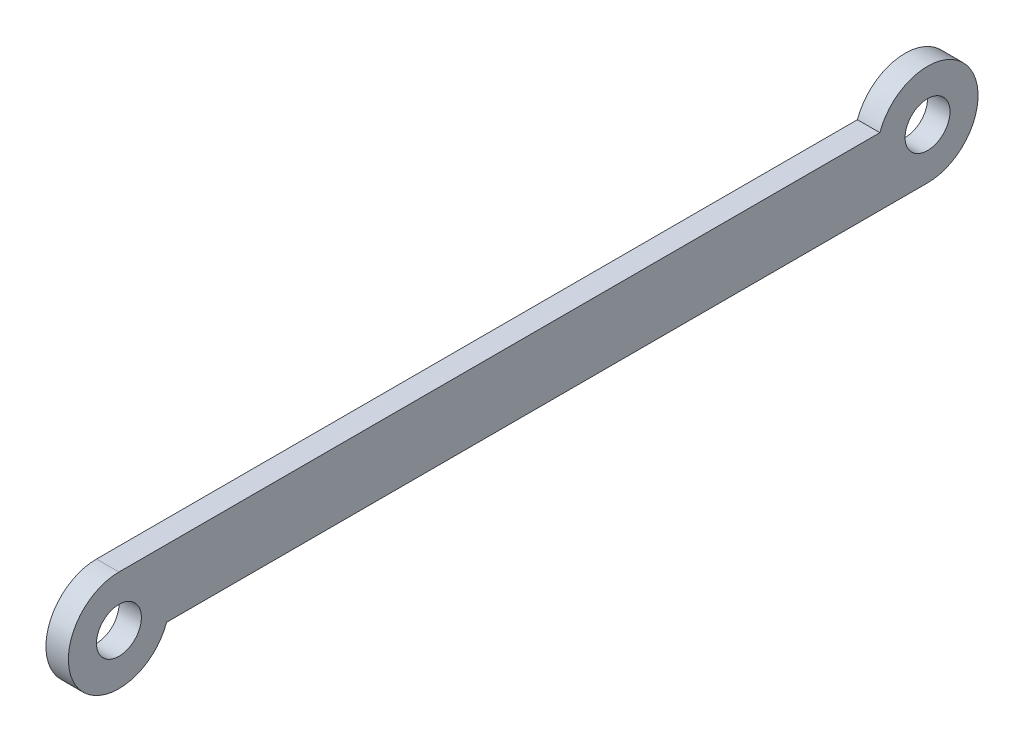
ISO-10303-21;
HEADER;
FILE_DESCRIPTION(('STEP AP214'),'2;1');
FILE_NAME('part.step','',(''),(''),'','','');
FILE_SCHEMA(('AUTOMOTIVE_DESIGN { 1 0 10303 214 1 1 1 1 }'));
ENDSEC;
DATA;
#1=APPLICATION_CONTEXT('core data for automotive mechanical design processes');
#2=APPLICATION_PROTOCOL_DEFINITION('international standard','automotive_design',2000,#1);
#3=PRODUCT_CONTEXT('',#1,'mechanical');
#4=PRODUCT('Part','Part','',(#3));
#5=PRODUCT_RELATED_PRODUCT_CATEGORY('part','',(#4));
#6=PRODUCT_DEFINITION_FORMATION('','',#4);
#7=PRODUCT_DEFINITION_CONTEXT('part definition',#1,'design');
#8=PRODUCT_DEFINITION('design','',#6,#7);
#9=PRODUCT_DEFINITION_SHAPE('','',#8);
#10=(LENGTH_UNIT() NAMED_UNIT(*) SI_UNIT(.MILLI.,.METRE.));
#11=(NAMED_UNIT(*) PLANE_ANGLE_UNIT() SI_UNIT($,.RADIAN.));
#12=(NAMED_UNIT(*) SI_UNIT($,.STERADIAN.) SOLID_ANGLE_UNIT());
#13=UNCERTAINTY_MEASURE_WITH_UNIT(LENGTH_MEASURE(1.E-05),#10,'distance_accuracy_value','');
#14=(GEOMETRIC_REPRESENTATION_CONTEXT(3) GLOBAL_UNCERTAINTY_ASSIGNED_CONTEXT((#13)) GLOBAL_UNIT_ASSIGNED_CONTEXT((#10,
#11,#12)) REPRESENTATION_CONTEXT('',''));
#15=CARTESIAN_POINT('',(0.,0.,0.));
#16=DIRECTION('',(0.,0.,1.));
#17=DIRECTION('',(1.,0.,0.));
#18=AXIS2_PLACEMENT_3D('',#15,#16,#17);
#19=CARTESIAN_POINT('',(0.,0.,0.));
#20=DIRECTION('',(1.,0.,0.));
#21=DIRECTION('',(0.,0.,-1.));
#22=AXIS2_PLACEMENT_3D('',#19,#20,#21);
#23=PLANE('',#22);
#24=CARTESIAN_POINT('',(0.,1.5,-36.));
#25=DIRECTION('',(1.,0.,0.));
#26=DIRECTION('',(0.,0.,-1.));
#27=AXIS2_PLACEMENT_3D('',#24,#25,#26);
#28=CIRCLE('',#27,2.25);
#29=CARTESIAN_POINT('',(0.,2.25,-33.8786796564404));
#30=VERTEX_POINT('',#29);
#31=CARTESIAN_POINT('',(0.,-0.750000000000001,-36.));
#32=VERTEX_POINT('',#31);
#33=EDGE_CURVE('E58',#30,#32,#28,.F.);
#34=ORIENTED_EDGE('',*,*,#33,.F.);
#35=DIRECTION('',(0.,0.,1.));
#36=VECTOR('',#35,1.);
#37=CARTESIAN_POINT('',(0.,2.25,0.));
#38=LINE('',#37,#36);
#39=CARTESIAN_POINT('',(0.,2.25,0.));
#40=VERTEX_POINT('',#39);
#41=EDGE_CURVE('E53',#40,#30,#38,.F.);
#42=ORIENTED_EDGE('',*,*,#41,.F.);
#43=CARTESIAN_POINT('',(0.,0.,0.));
#44=DIRECTION('',(1.,0.,0.));
#45=DIRECTION('',(0.,0.,-1.));
#46=AXIS2_PLACEMENT_3D('',#43,#44,#45);
#47=CIRCLE('',#46,2.25);
#48=CARTESIAN_POINT('',(0.,-0.750000000000004,-2.12132034355964));
#49=VERTEX_POINT('',#48);
#50=EDGE_CURVE('E70',#49,#40,#47,.F.);
#51=ORIENTED_EDGE('',*,*,#50,.F.);
#52=DIRECTION('',(0.,0.,-1.));
#53=VECTOR('',#52,1.);
#54=CARTESIAN_POINT('',(0.,-0.75,-36.));
#55=LINE('',#54,#53);
#56=EDGE_CURVE('E68',#32,#49,#55,.F.);
#57=ORIENTED_EDGE('',*,*,#56,.F.);
#58=EDGE_LOOP('',(#34,#42,#51,#57));
#59=FACE_BOUND('',#58,.T.);
#60=CARTESIAN_POINT('',(0.,0.,0.));
#61=DIRECTION('',(1.,0.,0.));
#62=DIRECTION('',(0.,0.,-1.));
#63=AXIS2_PLACEMENT_3D('',#60,#61,#62);
#64=CIRCLE('',#63,1.);
#65=CARTESIAN_POINT('',(0.,0.,-1.));
#66=VERTEX_POINT('',#65);
#67=EDGE_CURVE('E74',#66,#66,#64,.F.);
#68=ORIENTED_EDGE('',*,*,#67,.T.);
#69=EDGE_LOOP('',(#68));
#70=FACE_BOUND('',#69,.T.);
#71=CARTESIAN_POINT('',(0.,1.5,-36.));
#72=DIRECTION('',(1.,0.,0.));
#73=DIRECTION('',(0.,0.,-1.));
#74=AXIS2_PLACEMENT_3D('',#71,#72,#73);
#75=CIRCLE('',#74,1.);
#76=CARTESIAN_POINT('',(0.,1.5,-37.));
#77=VERTEX_POINT('',#76);
#78=EDGE_CURVE('E19',#77,#77,#75,.F.);
#79=ORIENTED_EDGE('',*,*,#78,.T.);
#80=EDGE_LOOP('',(#79));
#81=FACE_BOUND('',#80,.T.);
#82=ADVANCED_FACE('F16',(#59,#70,#81),#23,.T.);
#83=CARTESIAN_POINT('',(-1.,1.5,-36.));
#84=DIRECTION('',(1.,0.,0.));
#85=DIRECTION('',(0.,0.,-1.));
#86=AXIS2_PLACEMENT_3D('',#83,#84,#85);
#87=CYLINDRICAL_SURFACE('',#86,1.);
#88=CARTESIAN_POINT('',(-1.,1.5,-36.));
#89=DIRECTION('',(1.,0.,0.));
#90=DIRECTION('',(0.,0.,-1.));
#91=AXIS2_PLACEMENT_3D('',#88,#89,#90);
#92=CIRCLE('',#91,1.);
#93=CARTESIAN_POINT('',(-1.,1.5,-37.));
#94=VERTEX_POINT('',#93);
#95=EDGE_CURVE('E89',#94,#94,#92,.F.);
#96=ORIENTED_EDGE('',*,*,#95,.T.);
#97=EDGE_LOOP('',(#96));
#98=FACE_BOUND('',#97,.T.);
#99=ORIENTED_EDGE('',*,*,#78,.F.);
#100=EDGE_LOOP('',(#99));
#101=FACE_BOUND('',#100,.T.);
#102=ADVANCED_FACE('F99',(#98,#101),#87,.F.);
#103=CARTESIAN_POINT('',(-1.,0.,0.));
#104=DIRECTION('',(1.,0.,0.));
#105=DIRECTION('',(0.,0.,-1.));
#106=AXIS2_PLACEMENT_3D('',#103,#104,#105);
#107=CYLINDRICAL_SURFACE('',#106,1.);
#108=CARTESIAN_POINT('',(-1.,0.,0.));
#109=DIRECTION('',(1.,0.,0.));
#110=DIRECTION('',(0.,0.,-1.));
#111=AXIS2_PLACEMENT_3D('',#108,#109,#110);
#112=CIRCLE('',#111,1.);
#113=CARTESIAN_POINT('',(-1.,0.,-1.));
#114=VERTEX_POINT('',#113);
#115=EDGE_CURVE('E86',#114,#114,#112,.F.);
#116=ORIENTED_EDGE('',*,*,#115,.T.);
#117=EDGE_LOOP('',(#116));
#118=FACE_BOUND('',#117,.T.);
#119=ORIENTED_EDGE('',*,*,#67,.F.);
#120=EDGE_LOOP('',(#119));
#121=FACE_BOUND('',#120,.T.);
#122=ADVANCED_FACE('F101',(#118,#121),#107,.F.);
#123=CARTESIAN_POINT('',(-1.,-0.75,-36.));
#124=DIRECTION('',(0.,-1.,0.));
#125=DIRECTION('',(0.,0.,-1.));
#126=AXIS2_PLACEMENT_3D('',#123,#124,#125);
#127=PLANE('',#126);
#128=DIRECTION('',(0.,0.,-1.));
#129=VECTOR('',#128,1.);
#130=CARTESIAN_POINT('',(-1.,-0.750000000000004,0.));
#131=LINE('',#130,#129);
#132=CARTESIAN_POINT('',(-1.,-0.750000000000004,-2.12132034355964));
#133=VERTEX_POINT('',#132);
#134=CARTESIAN_POINT('',(-1.,-0.750000000000003,-36.));
#135=VERTEX_POINT('',#134);
#136=EDGE_CURVE('E78',#133,#135,#131,.T.);
#137=ORIENTED_EDGE('',*,*,#136,.T.);
#138=DIRECTION('',(1.,0.,0.));
#139=VECTOR('',#138,1.);
#140=CARTESIAN_POINT('',(-1.,-0.750000000000002,-36.));
#141=LINE('',#140,#139);
#142=EDGE_CURVE('E62',#32,#135,#141,.F.);
#143=ORIENTED_EDGE('',*,*,#142,.F.);
#144=ORIENTED_EDGE('',*,*,#56,.T.);
#145=DIRECTION('',(1.,0.,0.));
#146=VECTOR('',#145,1.);
#147=CARTESIAN_POINT('',(-1.,-0.750000000000004,-2.12132034355964));
#148=LINE('',#147,#146);
#149=EDGE_CURVE('E92',#133,#49,#148,.T.);
#150=ORIENTED_EDGE('',*,*,#149,.F.);
#151=EDGE_LOOP('',(#137,#143,#144,#150));
#152=FACE_BOUND('',#151,.T.);
#153=ADVANCED_FACE('F77',(#152),#127,.T.);
#154=CARTESIAN_POINT('',(-1.,1.5,-36.));
#155=DIRECTION('',(1.,0.,0.));
#156=DIRECTION('',(0.,0.,-1.));
#157=AXIS2_PLACEMENT_3D('',#154,#155,#156);
#158=CYLINDRICAL_SURFACE('',#157,2.25);
#159=DIRECTION('',(1.,0.,0.));
#160=VECTOR('',#159,1.);
#161=CARTESIAN_POINT('',(-1.,2.25,-33.8786796564404));
#162=LINE('',#161,#160);
#163=CARTESIAN_POINT('',(-1.,2.25,-33.8786796564404));
#164=VERTEX_POINT('',#163);
#165=EDGE_CURVE('E64',#30,#164,#162,.F.);
#166=ORIENTED_EDGE('',*,*,#165,.F.);
#167=ORIENTED_EDGE('',*,*,#33,.T.);
#168=ORIENTED_EDGE('',*,*,#142,.T.);
#169=CARTESIAN_POINT('',(-1.,1.5,-36.));
#170=DIRECTION('',(1.,0.,0.));
#171=DIRECTION('',(0.,0.,-1.));
#172=AXIS2_PLACEMENT_3D('',#169,#170,#171);
#173=CIRCLE('',#172,2.25);
#174=EDGE_CURVE('E84',#135,#164,#173,.T.);
#175=ORIENTED_EDGE('',*,*,#174,.T.);
#176=EDGE_LOOP('',(#166,#167,#168,#175));
#177=FACE_BOUND('',#176,.T.);
#178=ADVANCED_FACE('F60',(#177),#158,.T.);
#179=CARTESIAN_POINT('',(-1.,2.25,0.));
#180=DIRECTION('',(0.,1.,0.));
#181=DIRECTION('',(0.,0.,1.));
#182=AXIS2_PLACEMENT_3D('',#179,#180,#181);
#183=PLANE('',#182);
#184=DIRECTION('',(0.,0.,-1.));
#185=VECTOR('',#184,1.);
#186=CARTESIAN_POINT('',(-1.,2.25,0.));
#187=LINE('',#186,#185);
#188=CARTESIAN_POINT('',(-1.,2.25,0.));
#189=VERTEX_POINT('',#188);
#190=EDGE_CURVE('E25',#164,#189,#187,.F.);
#191=ORIENTED_EDGE('',*,*,#190,.T.);
#192=DIRECTION('',(1.,0.,0.));
#193=VECTOR('',#192,1.);
#194=CARTESIAN_POINT('',(-1.,2.25,0.));
#195=LINE('',#194,#193);
#196=EDGE_CURVE('E33',#40,#189,#195,.F.);
#197=ORIENTED_EDGE('',*,*,#196,.F.);
#198=ORIENTED_EDGE('',*,*,#41,.T.);
#199=ORIENTED_EDGE('',*,*,#165,.T.);
#200=EDGE_LOOP('',(#191,#197,#198,#199));
#201=FACE_BOUND('',#200,.T.);
#202=ADVANCED_FACE('F119',(#201),#183,.T.);
#203=CARTESIAN_POINT('',(-1.,0.,0.));
#204=DIRECTION('',(1.,0.,0.));
#205=DIRECTION('',(0.,0.,-1.));
#206=AXIS2_PLACEMENT_3D('',#203,#204,#205);
#207=CYLINDRICAL_SURFACE('',#206,2.25);
#208=CARTESIAN_POINT('',(-1.,0.,0.));
#209=DIRECTION('',(1.,0.,0.));
#210=DIRECTION('',(0.,0.,-1.));
#211=AXIS2_PLACEMENT_3D('',#208,#209,#210);
#212=CIRCLE('',#211,2.25);
#213=EDGE_CURVE('E11',#189,#133,#212,.T.);
#214=ORIENTED_EDGE('',*,*,#213,.T.);
#215=ORIENTED_EDGE('',*,*,#149,.T.);
#216=ORIENTED_EDGE('',*,*,#50,.T.);
#217=ORIENTED_EDGE('',*,*,#196,.T.);
#218=EDGE_LOOP('',(#214,#215,#216,#217));
#219=FACE_BOUND('',#218,.T.);
#220=ADVANCED_FACE('F113',(#219),#207,.T.);
#221=CARTESIAN_POINT('',(-1.,0.,0.));
#222=DIRECTION('',(1.,0.,0.));
#223=DIRECTION('',(0.,0.,-1.));
#224=AXIS2_PLACEMENT_3D('',#221,#222,#223);
#225=PLANE('',#224);
#226=ORIENTED_EDGE('',*,*,#190,.F.);
#227=ORIENTED_EDGE('',*,*,#174,.F.);
#228=ORIENTED_EDGE('',*,*,#136,.F.);
#229=ORIENTED_EDGE('',*,*,#213,.F.);
#230=EDGE_LOOP('',(#226,#227,#228,#229));
#231=FACE_BOUND('',#230,.T.);
#232=ORIENTED_EDGE('',*,*,#115,.F.);
#233=EDGE_LOOP('',(#232));
#234=FACE_BOUND('',#233,.T.);
#235=ORIENTED_EDGE('',*,*,#95,.F.);
#236=EDGE_LOOP('',(#235));
#237=FACE_BOUND('',#236,.T.);
#238=ADVANCED_FACE('F111',(#231,#234,#237),#225,.F.);
#239=CLOSED_SHELL('',(#82,#102,#122,#153,#178,#202,#220,#238));
#240=MANIFOLD_SOLID_BREP('B1',#239);
#241=ADVANCED_BREP_SHAPE_REPRESENTATION('',(#18,#240),#14);
#242=SHAPE_DEFINITION_REPRESENTATION(#9,#241);
ENDSEC;
END-ISO-10303-21;
